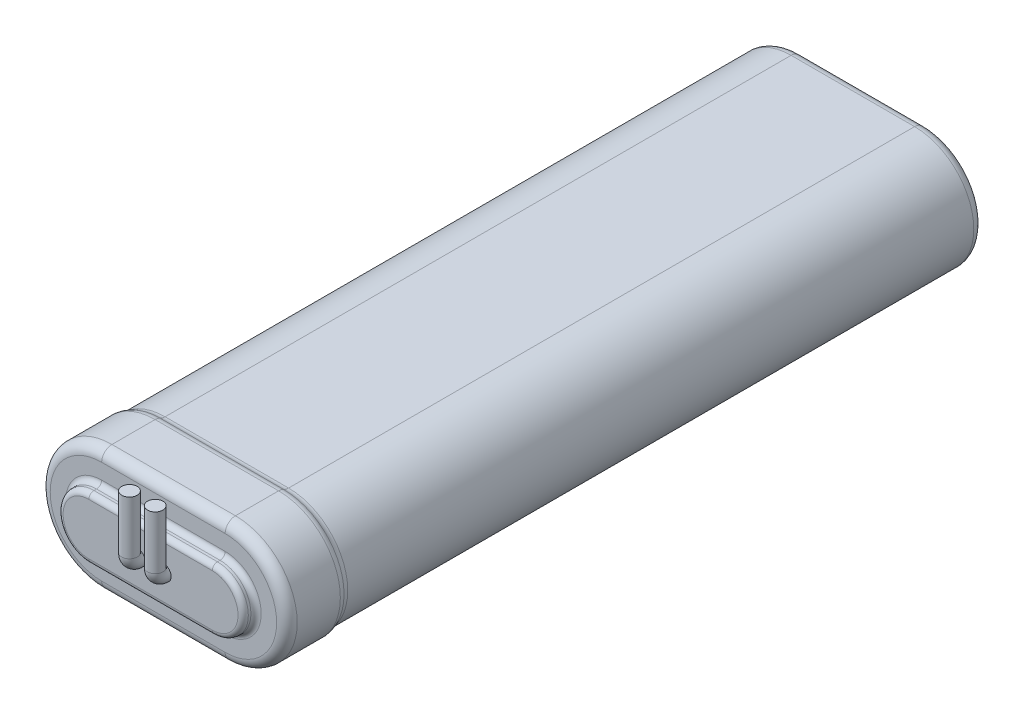
ISO-10303-21;
HEADER;
FILE_DESCRIPTION(('STEP AP214'),'2;1');
FILE_NAME('part.step','',(''),(''),'','','');
FILE_SCHEMA(('AUTOMOTIVE_DESIGN { 1 0 10303 214 1 1 1 1 }'));
ENDSEC;
DATA;
#1=APPLICATION_CONTEXT('core data for automotive mechanical design processes');
#2=APPLICATION_PROTOCOL_DEFINITION('international standard','automotive_design',2000,#1);
#3=PRODUCT_CONTEXT('',#1,'mechanical');
#4=PRODUCT('Part','Part','',(#3));
#5=PRODUCT_RELATED_PRODUCT_CATEGORY('part','',(#4));
#6=PRODUCT_DEFINITION_FORMATION('','',#4);
#7=PRODUCT_DEFINITION_CONTEXT('part definition',#1,'design');
#8=PRODUCT_DEFINITION('design','',#6,#7);
#9=PRODUCT_DEFINITION_SHAPE('','',#8);
#10=(LENGTH_UNIT() NAMED_UNIT(*) SI_UNIT(.MILLI.,.METRE.));
#11=(NAMED_UNIT(*) PLANE_ANGLE_UNIT() SI_UNIT($,.RADIAN.));
#12=(NAMED_UNIT(*) SI_UNIT($,.STERADIAN.) SOLID_ANGLE_UNIT());
#13=UNCERTAINTY_MEASURE_WITH_UNIT(LENGTH_MEASURE(1.E-05),#10,'distance_accuracy_value','');
#14=(GEOMETRIC_REPRESENTATION_CONTEXT(3) GLOBAL_UNCERTAINTY_ASSIGNED_CONTEXT((#13)) GLOBAL_UNIT_ASSIGNED_CONTEXT((#10,
#11,#12)) REPRESENTATION_CONTEXT('',''));
#15=CARTESIAN_POINT('',(0.,0.,0.));
#16=DIRECTION('',(0.,0.,1.));
#17=DIRECTION('',(1.,0.,0.));
#18=AXIS2_PLACEMENT_3D('',#15,#16,#17);
#19=CARTESIAN_POINT('',(-12.,0.,2.5));
#20=DIRECTION('',(0.,0.,1.));
#21=DIRECTION('',(1.,0.,0.));
#22=AXIS2_PLACEMENT_3D('',#19,#20,#21);
#23=PLANE('',#22);
#24=CARTESIAN_POINT('',(-2.5,0.,2.5));
#25=DIRECTION('',(0.,0.,1.));
#26=DIRECTION('',(1.,0.,0.));
#27=AXIS2_PLACEMENT_3D('',#24,#25,#26);
#28=CIRCLE('',#27,1.5);
#29=CARTESIAN_POINT('',(-2.5,-1.5,2.5));
#30=VERTEX_POINT('',#29);
#31=EDGE_CURVE('E11',#30,#30,#28,.T.);
#32=ORIENTED_EDGE('',*,*,#31,.F.);
#33=EDGE_LOOP('',(#32));
#34=FACE_BOUND('',#33,.T.);
#35=CARTESIAN_POINT('',(12.,0.,2.5));
#36=DIRECTION('',(0.,0.,1.));
#37=DIRECTION('',(1.,0.,0.));
#38=AXIS2_PLACEMENT_3D('',#35,#36,#37);
#39=CIRCLE('',#38,5.);
#40=CARTESIAN_POINT('',(12.,-5.,2.5));
#41=VERTEX_POINT('',#40);
#42=CARTESIAN_POINT('',(12.,5.,2.5));
#43=VERTEX_POINT('',#42);
#44=EDGE_CURVE('E269',#41,#43,#39,.T.);
#45=ORIENTED_EDGE('',*,*,#44,.T.);
#46=DIRECTION('',(-1.,0.,0.));
#47=VECTOR('',#46,1.);
#48=CARTESIAN_POINT('',(-12.,5.,2.5));
#49=LINE('',#48,#47);
#50=CARTESIAN_POINT('',(-12.,5.,2.5));
#51=VERTEX_POINT('',#50);
#52=EDGE_CURVE('E271',#43,#51,#49,.T.);
#53=ORIENTED_EDGE('',*,*,#52,.T.);
#54=CARTESIAN_POINT('',(-12.,0.,2.5));
#55=DIRECTION('',(0.,0.,1.));
#56=DIRECTION('',(1.,0.,0.));
#57=AXIS2_PLACEMENT_3D('',#54,#55,#56);
#58=CIRCLE('',#57,5.);
#59=CARTESIAN_POINT('',(-12.,-5.,2.5));
#60=VERTEX_POINT('',#59);
#61=EDGE_CURVE('E265',#51,#60,#58,.T.);
#62=ORIENTED_EDGE('',*,*,#61,.T.);
#63=DIRECTION('',(1.,0.,0.));
#64=VECTOR('',#63,1.);
#65=CARTESIAN_POINT('',(12.,-5.,2.5));
#66=LINE('',#65,#64);
#67=EDGE_CURVE('E267',#60,#41,#66,.T.);
#68=ORIENTED_EDGE('',*,*,#67,.T.);
#69=EDGE_LOOP('',(#45,#53,#62,#68));
#70=FACE_BOUND('',#69,.T.);
#71=CARTESIAN_POINT('',(2.5,0.,2.5));
#72=DIRECTION('',(0.,0.,1.));
#73=DIRECTION('',(1.,0.,0.));
#74=AXIS2_PLACEMENT_3D('',#71,#72,#73);
#75=CIRCLE('',#74,1.5);
#76=CARTESIAN_POINT('',(2.5,-1.5,2.5));
#77=VERTEX_POINT('',#76);
#78=EDGE_CURVE('E897',#77,#77,#75,.T.);
#79=ORIENTED_EDGE('',*,*,#78,.F.);
#80=EDGE_LOOP('',(#79));
#81=FACE_BOUND('',#80,.T.);
#82=ADVANCED_FACE('F16',(#34,#70,#81),#23,.T.);
#83=CARTESIAN_POINT('',(-12.,0.,0.));
#84=DIRECTION('',(0.,0.,-1.));
#85=DIRECTION('',(-1.,0.,0.));
#86=AXIS2_PLACEMENT_3D('',#83,#84,#85);
#87=PLANE('',#86);
#88=DIRECTION('',(-1.,0.,0.));
#89=VECTOR('',#88,1.);
#90=CARTESIAN_POINT('',(12.,7.,0.));
#91=LINE('',#90,#89);
#92=CARTESIAN_POINT('',(-12.,7.,0.));
#93=VERTEX_POINT('',#92);
#94=CARTESIAN_POINT('',(12.,7.,0.));
#95=VERTEX_POINT('',#94);
#96=EDGE_CURVE('E248',#93,#95,#91,.F.);
#97=ORIENTED_EDGE('',*,*,#96,.T.);
#98=CARTESIAN_POINT('',(12.,0.,0.));
#99=DIRECTION('',(0.,0.,-1.));
#100=DIRECTION('',(-1.,0.,0.));
#101=AXIS2_PLACEMENT_3D('',#98,#99,#100);
#102=CIRCLE('',#101,7.);
#103=CARTESIAN_POINT('',(12.,-7.,0.));
#104=VERTEX_POINT('',#103);
#105=EDGE_CURVE('E254',#95,#104,#102,.T.);
#106=ORIENTED_EDGE('',*,*,#105,.T.);
#107=DIRECTION('',(1.,0.,0.));
#108=VECTOR('',#107,1.);
#109=CARTESIAN_POINT('',(-12.,-7.,0.));
#110=LINE('',#109,#108);
#111=CARTESIAN_POINT('',(-12.,-7.,0.));
#112=VERTEX_POINT('',#111);
#113=EDGE_CURVE('E252',#104,#112,#110,.F.);
#114=ORIENTED_EDGE('',*,*,#113,.T.);
#115=CARTESIAN_POINT('',(-12.,0.,0.));
#116=DIRECTION('',(0.,0.,-1.));
#117=DIRECTION('',(-1.,0.,0.));
#118=AXIS2_PLACEMENT_3D('',#115,#116,#117);
#119=CIRCLE('',#118,7.);
#120=EDGE_CURVE('E250',#112,#93,#119,.T.);
#121=ORIENTED_EDGE('',*,*,#120,.T.);
#122=EDGE_LOOP('',(#97,#106,#114,#121));
#123=FACE_BOUND('',#122,.T.);
#124=DIRECTION('',(1.,0.,0.));
#125=VECTOR('',#124,1.);
#126=CARTESIAN_POINT('',(12.,-10.,0.));
#127=LINE('',#126,#125);
#128=CARTESIAN_POINT('',(-12.,-10.,0.));
#129=VERTEX_POINT('',#128);
#130=CARTESIAN_POINT('',(12.,-10.,0.));
#131=VERTEX_POINT('',#130);
#132=EDGE_CURVE('E193',#129,#131,#127,.T.);
#133=ORIENTED_EDGE('',*,*,#132,.T.);
#134=CARTESIAN_POINT('',(12.,0.,0.));
#135=DIRECTION('',(0.,0.,-1.));
#136=DIRECTION('',(-1.,0.,0.));
#137=AXIS2_PLACEMENT_3D('',#134,#135,#136);
#138=CIRCLE('',#137,10.);
#139=CARTESIAN_POINT('',(12.,10.,0.));
#140=VERTEX_POINT('',#139);
#141=EDGE_CURVE('E173',#131,#140,#138,.F.);
#142=ORIENTED_EDGE('',*,*,#141,.T.);
#143=DIRECTION('',(-1.,0.,0.));
#144=VECTOR('',#143,1.);
#145=CARTESIAN_POINT('',(-12.,10.,0.));
#146=LINE('',#145,#144);
#147=CARTESIAN_POINT('',(-12.,10.,0.));
#148=VERTEX_POINT('',#147);
#149=EDGE_CURVE('E182',#140,#148,#146,.T.);
#150=ORIENTED_EDGE('',*,*,#149,.T.);
#151=CARTESIAN_POINT('',(-12.,0.,0.));
#152=DIRECTION('',(0.,0.,-1.));
#153=DIRECTION('',(-1.,0.,0.));
#154=AXIS2_PLACEMENT_3D('',#151,#152,#153);
#155=CIRCLE('',#154,10.);
#156=EDGE_CURVE('E188',#148,#129,#155,.F.);
#157=ORIENTED_EDGE('',*,*,#156,.T.);
#158=EDGE_LOOP('',(#133,#142,#150,#157));
#159=FACE_BOUND('',#158,.T.);
#160=ADVANCED_FACE('F191',(#123,#159),#87,.F.);
#161=CARTESIAN_POINT('',(-12.,0.,-11.));
#162=DIRECTION('',(0.,0.,1.));
#163=DIRECTION('',(1.,0.,0.));
#164=AXIS2_PLACEMENT_3D('',#161,#162,#163);
#165=CYLINDRICAL_SURFACE('',#164,12.);
#166=DIRECTION('',(0.,0.,1.));
#167=VECTOR('',#166,1.);
#168=CARTESIAN_POINT('',(-12.,12.,-11.));
#169=LINE('',#168,#167);
#170=CARTESIAN_POINT('',(-12.,12.,-10.3863839824286));
#171=VERTEX_POINT('',#170);
#172=CARTESIAN_POINT('',(-12.,12.,-2.));
#173=VERTEX_POINT('',#172);
#174=EDGE_CURVE('E189',#171,#173,#169,.T.);
#175=ORIENTED_EDGE('',*,*,#174,.F.);
#176=CARTESIAN_POINT('',(-12.,0.,-10.3863839824286));
#177=DIRECTION('',(0.,0.,-1.));
#178=DIRECTION('',(-1.,0.,0.));
#179=AXIS2_PLACEMENT_3D('',#176,#177,#178);
#180=CIRCLE('',#179,12.);
#181=CARTESIAN_POINT('',(-12.,-12.,-10.3863839824286));
#182=VERTEX_POINT('',#181);
#183=EDGE_CURVE('E328',#171,#182,#180,.F.);
#184=ORIENTED_EDGE('',*,*,#183,.T.);
#185=DIRECTION('',(0.,0.,1.));
#186=VECTOR('',#185,1.);
#187=CARTESIAN_POINT('',(-12.,-12.,-11.));
#188=LINE('',#187,#186);
#189=CARTESIAN_POINT('',(-12.,-12.,-2.));
#190=VERTEX_POINT('',#189);
#191=EDGE_CURVE('E374',#182,#190,#188,.T.);
#192=ORIENTED_EDGE('',*,*,#191,.T.);
#193=CARTESIAN_POINT('',(-12.,0.,-2.));
#194=DIRECTION('',(0.,0.,-1.));
#195=DIRECTION('',(-1.,0.,0.));
#196=AXIS2_PLACEMENT_3D('',#193,#194,#195);
#197=CIRCLE('',#196,12.);
#198=EDGE_CURVE('E203',#190,#173,#197,.T.);
#199=ORIENTED_EDGE('',*,*,#198,.T.);
#200=EDGE_LOOP('',(#175,#184,#192,#199));
#201=FACE_BOUND('',#200,.T.);
#202=ADVANCED_FACE('F390',(#201),#165,.T.);
#203=CARTESIAN_POINT('',(-12.,12.,-11.));
#204=DIRECTION('',(0.,1.,0.));
#205=DIRECTION('',(0.,0.,1.));
#206=AXIS2_PLACEMENT_3D('',#203,#204,#205);
#207=PLANE('',#206);
#208=DIRECTION('',(0.,0.,1.));
#209=VECTOR('',#208,1.);
#210=CARTESIAN_POINT('',(12.,12.,-11.));
#211=LINE('',#210,#209);
#212=CARTESIAN_POINT('',(12.,12.,-10.3863839824286));
#213=VERTEX_POINT('',#212);
#214=CARTESIAN_POINT('',(12.,12.,-2.));
#215=VERTEX_POINT('',#214);
#216=EDGE_CURVE('E369',#213,#215,#211,.T.);
#217=ORIENTED_EDGE('',*,*,#216,.F.);
#218=DIRECTION('',(-1.,0.,0.));
#219=VECTOR('',#218,1.);
#220=CARTESIAN_POINT('',(-12.,12.,-10.3863839824286));
#221=LINE('',#220,#219);
#222=EDGE_CURVE('E39',#213,#171,#221,.T.);
#223=ORIENTED_EDGE('',*,*,#222,.T.);
#224=ORIENTED_EDGE('',*,*,#174,.T.);
#225=DIRECTION('',(-1.,0.,0.));
#226=VECTOR('',#225,1.);
#227=CARTESIAN_POINT('',(12.,12.,-2.));
#228=LINE('',#227,#226);
#229=EDGE_CURVE('E224',#173,#215,#228,.F.);
#230=ORIENTED_EDGE('',*,*,#229,.T.);
#231=EDGE_LOOP('',(#217,#223,#224,#230));
#232=FACE_BOUND('',#231,.T.);
#233=ADVANCED_FACE('F371',(#232),#207,.T.);
#234=CARTESIAN_POINT('',(12.,0.,-11.));
#235=DIRECTION('',(0.,0.,1.));
#236=DIRECTION('',(1.,0.,0.));
#237=AXIS2_PLACEMENT_3D('',#234,#235,#236);
#238=CYLINDRICAL_SURFACE('',#237,12.);
#239=DIRECTION('',(0.,0.,1.));
#240=VECTOR('',#239,1.);
#241=CARTESIAN_POINT('',(12.,-12.,-11.));
#242=LINE('',#241,#240);
#243=CARTESIAN_POINT('',(12.,-12.,-10.3863839824286));
#244=VERTEX_POINT('',#243);
#245=CARTESIAN_POINT('',(12.,-12.,-2.));
#246=VERTEX_POINT('',#245);
#247=EDGE_CURVE('E370',#244,#246,#242,.T.);
#248=ORIENTED_EDGE('',*,*,#247,.F.);
#249=CARTESIAN_POINT('',(12.,0.,-10.3863839824286));
#250=DIRECTION('',(0.,0.,-1.));
#251=DIRECTION('',(-1.,0.,0.));
#252=AXIS2_PLACEMENT_3D('',#249,#250,#251);
#253=CIRCLE('',#252,12.);
#254=EDGE_CURVE('E309',#244,#213,#253,.F.);
#255=ORIENTED_EDGE('',*,*,#254,.T.);
#256=ORIENTED_EDGE('',*,*,#216,.T.);
#257=CARTESIAN_POINT('',(12.,0.,-2.));
#258=DIRECTION('',(0.,0.,-1.));
#259=DIRECTION('',(-1.,0.,0.));
#260=AXIS2_PLACEMENT_3D('',#257,#258,#259);
#261=CIRCLE('',#260,12.);
#262=EDGE_CURVE('E175',#215,#246,#261,.T.);
#263=ORIENTED_EDGE('',*,*,#262,.T.);
#264=EDGE_LOOP('',(#248,#255,#256,#263));
#265=FACE_BOUND('',#264,.T.);
#266=ADVANCED_FACE('F368',(#265),#238,.T.);
#267=CARTESIAN_POINT('',(-12.,-12.,-11.));
#268=DIRECTION('',(0.,-1.,0.));
#269=DIRECTION('',(0.,0.,-1.));
#270=AXIS2_PLACEMENT_3D('',#267,#268,#269);
#271=PLANE('',#270);
#272=ORIENTED_EDGE('',*,*,#191,.F.);
#273=DIRECTION('',(1.,0.,0.));
#274=VECTOR('',#273,1.);
#275=CARTESIAN_POINT('',(12.,-12.,-10.3863839824286));
#276=LINE('',#275,#274);
#277=EDGE_CURVE('E324',#182,#244,#276,.T.);
#278=ORIENTED_EDGE('',*,*,#277,.T.);
#279=ORIENTED_EDGE('',*,*,#247,.T.);
#280=DIRECTION('',(1.,0.,0.));
#281=VECTOR('',#280,1.);
#282=CARTESIAN_POINT('',(-12.,-12.,-2.));
#283=LINE('',#282,#281);
#284=EDGE_CURVE('E196',#246,#190,#283,.F.);
#285=ORIENTED_EDGE('',*,*,#284,.T.);
#286=EDGE_LOOP('',(#272,#278,#279,#285));
#287=FACE_BOUND('',#286,.T.);
#288=ADVANCED_FACE('F388',(#287),#271,.T.);
#289=CARTESIAN_POINT('',(-12.,0.,-136.));
#290=DIRECTION('',(0.,0.,1.));
#291=DIRECTION('',(1.,0.,0.));
#292=AXIS2_PLACEMENT_3D('',#289,#290,#291);
#293=CYLINDRICAL_SURFACE('',#292,11.5);
#294=DIRECTION('',(0.,0.,1.));
#295=VECTOR('',#294,1.);
#296=CARTESIAN_POINT('',(-12.,-11.5,-136.));
#297=LINE('',#296,#295);
#298=CARTESIAN_POINT('',(-12.,-11.5,-134.));
#299=VERTEX_POINT('',#298);
#300=CARTESIAN_POINT('',(-12.,-11.5,-12.3228756555323));
#301=VERTEX_POINT('',#300);
#302=EDGE_CURVE('E921',#299,#301,#297,.T.);
#303=ORIENTED_EDGE('',*,*,#302,.T.);
#304=CARTESIAN_POINT('',(-12.,0.,-12.3228756555323));
#305=DIRECTION('',(0.,0.,1.));
#306=DIRECTION('',(1.,0.,0.));
#307=AXIS2_PLACEMENT_3D('',#304,#305,#306);
#308=CIRCLE('',#307,11.5);
#309=CARTESIAN_POINT('',(-12.,11.5,-12.3228756555323));
#310=VERTEX_POINT('',#309);
#311=EDGE_CURVE('E279',#301,#310,#308,.F.);
#312=ORIENTED_EDGE('',*,*,#311,.T.);
#313=DIRECTION('',(0.,0.,1.));
#314=VECTOR('',#313,1.);
#315=CARTESIAN_POINT('',(-12.,11.5,-136.));
#316=LINE('',#315,#314);
#317=CARTESIAN_POINT('',(-12.,11.5,-134.));
#318=VERTEX_POINT('',#317);
#319=EDGE_CURVE('E378',#318,#310,#316,.T.);
#320=ORIENTED_EDGE('',*,*,#319,.F.);
#321=CARTESIAN_POINT('',(-12.,0.,-134.));
#322=DIRECTION('',(0.,0.,1.));
#323=DIRECTION('',(1.,0.,0.));
#324=AXIS2_PLACEMENT_3D('',#321,#322,#323);
#325=CIRCLE('',#324,11.5);
#326=EDGE_CURVE('E222',#318,#299,#325,.T.);
#327=ORIENTED_EDGE('',*,*,#326,.T.);
#328=EDGE_LOOP('',(#303,#312,#320,#327));
#329=FACE_BOUND('',#328,.T.);
#330=ADVANCED_FACE('F439',(#329),#293,.T.);
#331=CARTESIAN_POINT('',(12.,11.5,-136.));
#332=DIRECTION('',(0.,1.,0.));
#333=DIRECTION('',(0.,0.,1.));
#334=AXIS2_PLACEMENT_3D('',#331,#332,#333);
#335=PLANE('',#334);
#336=ORIENTED_EDGE('',*,*,#319,.T.);
#337=DIRECTION('',(-1.,0.,0.));
#338=VECTOR('',#337,1.);
#339=CARTESIAN_POINT('',(12.,11.5,-12.3228756555323));
#340=LINE('',#339,#338);
#341=CARTESIAN_POINT('',(12.,11.5,-12.3228756555323));
#342=VERTEX_POINT('',#341);
#343=EDGE_CURVE('E306',#310,#342,#340,.F.);
#344=ORIENTED_EDGE('',*,*,#343,.T.);
#345=DIRECTION('',(0.,0.,1.));
#346=VECTOR('',#345,1.);
#347=CARTESIAN_POINT('',(12.,11.5,-136.));
#348=LINE('',#347,#346);
#349=CARTESIAN_POINT('',(12.,11.5,-134.));
#350=VERTEX_POINT('',#349);
#351=EDGE_CURVE('E924',#350,#342,#348,.T.);
#352=ORIENTED_EDGE('',*,*,#351,.F.);
#353=DIRECTION('',(-1.,0.,0.));
#354=VECTOR('',#353,1.);
#355=CARTESIAN_POINT('',(-12.,11.5,-134.));
#356=LINE('',#355,#354);
#357=EDGE_CURVE('E220',#350,#318,#356,.T.);
#358=ORIENTED_EDGE('',*,*,#357,.T.);
#359=EDGE_LOOP('',(#336,#344,#352,#358));
#360=FACE_BOUND('',#359,.T.);
#361=ADVANCED_FACE('F435',(#360),#335,.T.);
#362=CARTESIAN_POINT('',(12.,0.,-136.));
#363=DIRECTION('',(0.,0.,1.));
#364=DIRECTION('',(1.,0.,0.));
#365=AXIS2_PLACEMENT_3D('',#362,#363,#364);
#366=CYLINDRICAL_SURFACE('',#365,11.5);
#367=ORIENTED_EDGE('',*,*,#351,.T.);
#368=CARTESIAN_POINT('',(12.,0.,-12.3228756555323));
#369=DIRECTION('',(0.,0.,1.));
#370=DIRECTION('',(1.,0.,0.));
#371=AXIS2_PLACEMENT_3D('',#368,#369,#370);
#372=CIRCLE('',#371,11.5);
#373=CARTESIAN_POINT('',(12.,-11.5,-12.3228756555323));
#374=VERTEX_POINT('',#373);
#375=EDGE_CURVE('E304',#342,#374,#372,.F.);
#376=ORIENTED_EDGE('',*,*,#375,.T.);
#377=DIRECTION('',(0.,0.,1.));
#378=VECTOR('',#377,1.);
#379=CARTESIAN_POINT('',(12.,-11.5,-136.));
#380=LINE('',#379,#378);
#381=CARTESIAN_POINT('',(12.,-11.5,-134.));
#382=VERTEX_POINT('',#381);
#383=EDGE_CURVE('E927',#382,#374,#380,.T.);
#384=ORIENTED_EDGE('',*,*,#383,.F.);
#385=CARTESIAN_POINT('',(12.,0.,-134.));
#386=DIRECTION('',(0.,0.,1.));
#387=DIRECTION('',(1.,0.,0.));
#388=AXIS2_PLACEMENT_3D('',#385,#386,#387);
#389=CIRCLE('',#388,11.5);
#390=EDGE_CURVE('E218',#382,#350,#389,.T.);
#391=ORIENTED_EDGE('',*,*,#390,.T.);
#392=EDGE_LOOP('',(#367,#376,#384,#391));
#393=FACE_BOUND('',#392,.T.);
#394=ADVANCED_FACE('F438',(#393),#366,.T.);
#395=CARTESIAN_POINT('',(-12.,-11.5,-136.));
#396=DIRECTION('',(0.,-1.,0.));
#397=DIRECTION('',(0.,0.,-1.));
#398=AXIS2_PLACEMENT_3D('',#395,#396,#397);
#399=PLANE('',#398);
#400=ORIENTED_EDGE('',*,*,#383,.T.);
#401=DIRECTION('',(1.,0.,0.));
#402=VECTOR('',#401,1.);
#403=CARTESIAN_POINT('',(-12.,-11.5,-12.3228756555323));
#404=LINE('',#403,#402);
#405=EDGE_CURVE('E302',#374,#301,#404,.F.);
#406=ORIENTED_EDGE('',*,*,#405,.T.);
#407=ORIENTED_EDGE('',*,*,#302,.F.);
#408=DIRECTION('',(1.,0.,0.));
#409=VECTOR('',#408,1.);
#410=CARTESIAN_POINT('',(12.,-11.5,-134.));
#411=LINE('',#410,#409);
#412=EDGE_CURVE('E206',#299,#382,#411,.T.);
#413=ORIENTED_EDGE('',*,*,#412,.T.);
#414=EDGE_LOOP('',(#400,#406,#407,#413));
#415=FACE_BOUND('',#414,.T.);
#416=ADVANCED_FACE('F433',(#415),#399,.T.);
#417=CARTESIAN_POINT('',(-12.,0.,-136.));
#418=DIRECTION('',(0.,0.,1.));
#419=DIRECTION('',(1.,0.,0.));
#420=AXIS2_PLACEMENT_3D('',#417,#418,#419);
#421=PLANE('',#420);
#422=CARTESIAN_POINT('',(12.,0.,-136.));
#423=DIRECTION('',(0.,0.,1.));
#424=DIRECTION('',(1.,0.,0.));
#425=AXIS2_PLACEMENT_3D('',#422,#423,#424);
#426=CIRCLE('',#425,9.5);
#427=CARTESIAN_POINT('',(12.,9.5,-136.));
#428=VERTEX_POINT('',#427);
#429=CARTESIAN_POINT('',(12.,-9.5,-136.));
#430=VERTEX_POINT('',#429);
#431=EDGE_CURVE('E213',#428,#430,#426,.F.);
#432=ORIENTED_EDGE('',*,*,#431,.T.);
#433=DIRECTION('',(1.,0.,0.));
#434=VECTOR('',#433,1.);
#435=CARTESIAN_POINT('',(-12.,-9.5,-136.));
#436=LINE('',#435,#434);
#437=CARTESIAN_POINT('',(-12.,-9.5,-136.));
#438=VERTEX_POINT('',#437);
#439=EDGE_CURVE('E215',#430,#438,#436,.F.);
#440=ORIENTED_EDGE('',*,*,#439,.T.);
#441=CARTESIAN_POINT('',(-12.,0.,-136.));
#442=DIRECTION('',(0.,0.,1.));
#443=DIRECTION('',(1.,0.,0.));
#444=AXIS2_PLACEMENT_3D('',#441,#442,#443);
#445=CIRCLE('',#444,9.5);
#446=CARTESIAN_POINT('',(-12.,9.5,-136.));
#447=VERTEX_POINT('',#446);
#448=EDGE_CURVE('E209',#438,#447,#445,.F.);
#449=ORIENTED_EDGE('',*,*,#448,.T.);
#450=DIRECTION('',(-1.,0.,0.));
#451=VECTOR('',#450,1.);
#452=CARTESIAN_POINT('',(12.,9.5,-136.));
#453=LINE('',#452,#451);
#454=EDGE_CURVE('E211',#447,#428,#453,.F.);
#455=ORIENTED_EDGE('',*,*,#454,.T.);
#456=EDGE_LOOP('',(#432,#440,#449,#455));
#457=FACE_BOUND('',#456,.T.);
#458=ADVANCED_FACE('F429',(#457),#421,.F.);
#459=CARTESIAN_POINT('',(-12.,0.,2.5));
#460=DIRECTION('',(0.,0.,-1.));
#461=DIRECTION('',(-1.,0.,0.));
#462=AXIS2_PLACEMENT_3D('',#459,#460,#461);
#463=CYLINDRICAL_SURFACE('',#462,6.);
#464=DIRECTION('',(0.,0.,-1.));
#465=VECTOR('',#464,1.);
#466=CARTESIAN_POINT('',(-12.,6.,2.5));
#467=LINE('',#466,#465);
#468=CARTESIAN_POINT('',(-12.,6.,1.5));
#469=VERTEX_POINT('',#468);
#470=CARTESIAN_POINT('',(-12.,6.,1.));
#471=VERTEX_POINT('',#470);
#472=EDGE_CURVE('E233',#469,#471,#467,.T.);
#473=ORIENTED_EDGE('',*,*,#472,.T.);
#474=CARTESIAN_POINT('',(-12.,0.,1.));
#475=DIRECTION('',(0.,0.,-1.));
#476=DIRECTION('',(-1.,0.,0.));
#477=AXIS2_PLACEMENT_3D('',#474,#475,#476);
#478=CIRCLE('',#477,6.);
#479=CARTESIAN_POINT('',(-12.,-6.,1.));
#480=VERTEX_POINT('',#479);
#481=EDGE_CURVE('E263',#471,#480,#478,.F.);
#482=ORIENTED_EDGE('',*,*,#481,.T.);
#483=DIRECTION('',(0.,0.,-1.));
#484=VECTOR('',#483,1.);
#485=CARTESIAN_POINT('',(-12.,-6.,2.5));
#486=LINE('',#485,#484);
#487=CARTESIAN_POINT('',(-12.,-6.,1.5));
#488=VERTEX_POINT('',#487);
#489=EDGE_CURVE('E918',#488,#480,#486,.T.);
#490=ORIENTED_EDGE('',*,*,#489,.F.);
#491=CARTESIAN_POINT('',(-12.,0.,1.5));
#492=DIRECTION('',(0.,0.,1.));
#493=DIRECTION('',(1.,0.,0.));
#494=AXIS2_PLACEMENT_3D('',#491,#492,#493);
#495=CIRCLE('',#494,6.);
#496=EDGE_CURVE('E261',#488,#469,#495,.F.);
#497=ORIENTED_EDGE('',*,*,#496,.T.);
#498=EDGE_LOOP('',(#473,#482,#490,#497));
#499=FACE_BOUND('',#498,.T.);
#500=ADVANCED_FACE('F425',(#499),#463,.T.);
#501=CARTESIAN_POINT('',(-12.,-6.,2.5));
#502=DIRECTION('',(0.,1.,0.));
#503=DIRECTION('',(0.,0.,1.));
#504=AXIS2_PLACEMENT_3D('',#501,#502,#503);
#505=PLANE('',#504);
#506=ORIENTED_EDGE('',*,*,#489,.T.);
#507=DIRECTION('',(1.,0.,0.));
#508=VECTOR('',#507,1.);
#509=CARTESIAN_POINT('',(12.,-6.,1.));
#510=LINE('',#509,#508);
#511=CARTESIAN_POINT('',(12.,-6.,1.));
#512=VERTEX_POINT('',#511);
#513=EDGE_CURVE('E259',#480,#512,#510,.T.);
#514=ORIENTED_EDGE('',*,*,#513,.T.);
#515=DIRECTION('',(0.,0.,-1.));
#516=VECTOR('',#515,1.);
#517=CARTESIAN_POINT('',(12.,-6.,2.5));
#518=LINE('',#517,#516);
#519=CARTESIAN_POINT('',(12.,-6.,1.5));
#520=VERTEX_POINT('',#519);
#521=EDGE_CURVE('E915',#520,#512,#518,.T.);
#522=ORIENTED_EDGE('',*,*,#521,.F.);
#523=DIRECTION('',(1.,0.,0.));
#524=VECTOR('',#523,1.);
#525=CARTESIAN_POINT('',(-12.,-6.,1.5));
#526=LINE('',#525,#524);
#527=EDGE_CURVE('E257',#520,#488,#526,.F.);
#528=ORIENTED_EDGE('',*,*,#527,.T.);
#529=EDGE_LOOP('',(#506,#514,#522,#528));
#530=FACE_BOUND('',#529,.T.);
#531=ADVANCED_FACE('F421',(#530),#505,.F.);
#532=CARTESIAN_POINT('',(12.,0.,2.5));
#533=DIRECTION('',(0.,0.,-1.));
#534=DIRECTION('',(-1.,0.,0.));
#535=AXIS2_PLACEMENT_3D('',#532,#533,#534);
#536=CYLINDRICAL_SURFACE('',#535,6.);
#537=ORIENTED_EDGE('',*,*,#521,.T.);
#538=CARTESIAN_POINT('',(12.,0.,1.));
#539=DIRECTION('',(0.,0.,-1.));
#540=DIRECTION('',(-1.,0.,0.));
#541=AXIS2_PLACEMENT_3D('',#538,#539,#540);
#542=CIRCLE('',#541,6.);
#543=CARTESIAN_POINT('',(12.,6.,1.));
#544=VERTEX_POINT('',#543);
#545=EDGE_CURVE('E245',#512,#544,#542,.F.);
#546=ORIENTED_EDGE('',*,*,#545,.T.);
#547=DIRECTION('',(0.,0.,-1.));
#548=VECTOR('',#547,1.);
#549=CARTESIAN_POINT('',(12.,6.,2.5));
#550=LINE('',#549,#548);
#551=CARTESIAN_POINT('',(12.,6.,1.5));
#552=VERTEX_POINT('',#551);
#553=EDGE_CURVE('E912',#552,#544,#550,.T.);
#554=ORIENTED_EDGE('',*,*,#553,.F.);
#555=CARTESIAN_POINT('',(12.,0.,1.5));
#556=DIRECTION('',(0.,0.,1.));
#557=DIRECTION('',(1.,0.,0.));
#558=AXIS2_PLACEMENT_3D('',#555,#556,#557);
#559=CIRCLE('',#558,6.);
#560=EDGE_CURVE('E226',#552,#520,#559,.F.);
#561=ORIENTED_EDGE('',*,*,#560,.T.);
#562=EDGE_LOOP('',(#537,#546,#554,#561));
#563=FACE_BOUND('',#562,.T.);
#564=ADVANCED_FACE('F417',(#563),#536,.T.);
#565=CARTESIAN_POINT('',(12.,6.,2.5));
#566=DIRECTION('',(0.,-1.,0.));
#567=DIRECTION('',(0.,0.,-1.));
#568=AXIS2_PLACEMENT_3D('',#565,#566,#567);
#569=PLANE('',#568);
#570=ORIENTED_EDGE('',*,*,#472,.F.);
#571=DIRECTION('',(-1.,0.,0.));
#572=VECTOR('',#571,1.);
#573=CARTESIAN_POINT('',(12.,6.,1.5));
#574=LINE('',#573,#572);
#575=EDGE_CURVE('E276',#469,#552,#574,.F.);
#576=ORIENTED_EDGE('',*,*,#575,.T.);
#577=ORIENTED_EDGE('',*,*,#553,.T.);
#578=DIRECTION('',(-1.,0.,0.));
#579=VECTOR('',#578,1.);
#580=CARTESIAN_POINT('',(-12.,6.,1.));
#581=LINE('',#580,#579);
#582=EDGE_CURVE('E274',#544,#471,#581,.T.);
#583=ORIENTED_EDGE('',*,*,#582,.T.);
#584=EDGE_LOOP('',(#570,#576,#577,#583));
#585=FACE_BOUND('',#584,.T.);
#586=ADVANCED_FACE('F414',(#585),#569,.F.);
#587=CARTESIAN_POINT('',(-12.,0.,-2.));
#588=DIRECTION('',(0.,0.,-1.));
#589=DIRECTION('',(-1.,0.,0.));
#590=AXIS2_PLACEMENT_3D('',#587,#588,#589);
#591=TOROIDAL_SURFACE('',#590,10.,2.);
#592=CARTESIAN_POINT('',(-12.,10.,-2.));
#593=DIRECTION('',(1.,0.,0.));
#594=DIRECTION('',(0.,0.,-1.));
#595=AXIS2_PLACEMENT_3D('',#592,#593,#594);
#596=CIRCLE('',#595,2.);
#597=EDGE_CURVE('E185',#173,#148,#596,.T.);
#598=ORIENTED_EDGE('',*,*,#597,.F.);
#599=ORIENTED_EDGE('',*,*,#198,.F.);
#600=CARTESIAN_POINT('',(-12.,-10.,-2.));
#601=DIRECTION('',(1.,0.,0.));
#602=DIRECTION('',(0.,0.,-1.));
#603=AXIS2_PLACEMENT_3D('',#600,#601,#602);
#604=CIRCLE('',#603,2.);
#605=EDGE_CURVE('E230',#129,#190,#604,.T.);
#606=ORIENTED_EDGE('',*,*,#605,.F.);
#607=ORIENTED_EDGE('',*,*,#156,.F.);
#608=EDGE_LOOP('',(#598,#599,#606,#607));
#609=FACE_BOUND('',#608,.T.);
#610=ADVANCED_FACE('F382',(#609),#591,.T.);
#611=CARTESIAN_POINT('',(-12.,-10.,-2.));
#612=DIRECTION('',(-1.,0.,0.));
#613=DIRECTION('',(0.,0.,1.));
#614=AXIS2_PLACEMENT_3D('',#611,#612,#613);
#615=CYLINDRICAL_SURFACE('',#614,2.);
#616=ORIENTED_EDGE('',*,*,#605,.T.);
#617=ORIENTED_EDGE('',*,*,#284,.F.);
#618=CARTESIAN_POINT('',(12.,-10.,-2.));
#619=DIRECTION('',(1.,0.,0.));
#620=DIRECTION('',(0.,0.,-1.));
#621=AXIS2_PLACEMENT_3D('',#618,#619,#620);
#622=CIRCLE('',#621,2.);
#623=EDGE_CURVE('E178',#131,#246,#622,.T.);
#624=ORIENTED_EDGE('',*,*,#623,.F.);
#625=ORIENTED_EDGE('',*,*,#132,.F.);
#626=EDGE_LOOP('',(#616,#617,#624,#625));
#627=FACE_BOUND('',#626,.T.);
#628=ADVANCED_FACE('F385',(#627),#615,.T.);
#629=CARTESIAN_POINT('',(-12.,10.,-2.));
#630=DIRECTION('',(1.,0.,0.));
#631=DIRECTION('',(0.,0.,-1.));
#632=AXIS2_PLACEMENT_3D('',#629,#630,#631);
#633=CYLINDRICAL_SURFACE('',#632,2.);
#634=ORIENTED_EDGE('',*,*,#597,.T.);
#635=ORIENTED_EDGE('',*,*,#149,.F.);
#636=CARTESIAN_POINT('',(12.,10.,-2.));
#637=DIRECTION('',(1.,0.,0.));
#638=DIRECTION('',(0.,0.,-1.));
#639=AXIS2_PLACEMENT_3D('',#636,#637,#638);
#640=CIRCLE('',#639,2.);
#641=EDGE_CURVE('E168',#215,#140,#640,.T.);
#642=ORIENTED_EDGE('',*,*,#641,.F.);
#643=ORIENTED_EDGE('',*,*,#229,.F.);
#644=EDGE_LOOP('',(#634,#635,#642,#643));
#645=FACE_BOUND('',#644,.T.);
#646=ADVANCED_FACE('F183',(#645),#633,.T.);
#647=CARTESIAN_POINT('',(12.,0.,-2.));
#648=DIRECTION('',(0.,0.,-1.));
#649=DIRECTION('',(-1.,0.,0.));
#650=AXIS2_PLACEMENT_3D('',#647,#648,#649);
#651=TOROIDAL_SURFACE('',#650,10.,2.);
#652=ORIENTED_EDGE('',*,*,#623,.T.);
#653=ORIENTED_EDGE('',*,*,#262,.F.);
#654=ORIENTED_EDGE('',*,*,#641,.T.);
#655=ORIENTED_EDGE('',*,*,#141,.F.);
#656=EDGE_LOOP('',(#652,#653,#654,#655));
#657=FACE_BOUND('',#656,.T.);
#658=ADVANCED_FACE('F171',(#657),#651,.T.);
#659=CARTESIAN_POINT('',(12.,9.5,-134.));
#660=DIRECTION('',(1.,0.,0.));
#661=DIRECTION('',(0.,0.,-1.));
#662=AXIS2_PLACEMENT_3D('',#659,#660,#661);
#663=CYLINDRICAL_SURFACE('',#662,2.);
#664=CARTESIAN_POINT('',(12.,9.5,-134.));
#665=DIRECTION('',(1.,0.,0.));
#666=DIRECTION('',(0.,0.,-1.));
#667=AXIS2_PLACEMENT_3D('',#664,#665,#666);
#668=CIRCLE('',#667,2.);
#669=EDGE_CURVE('E239',#428,#350,#668,.T.);
#670=ORIENTED_EDGE('',*,*,#669,.F.);
#671=ORIENTED_EDGE('',*,*,#454,.F.);
#672=CARTESIAN_POINT('',(-12.,9.5,-134.));
#673=DIRECTION('',(-1.,0.,0.));
#674=DIRECTION('',(0.,0.,1.));
#675=AXIS2_PLACEMENT_3D('',#672,#673,#674);
#676=CIRCLE('',#675,2.);
#677=EDGE_CURVE('E179',#318,#447,#676,.T.);
#678=ORIENTED_EDGE('',*,*,#677,.F.);
#679=ORIENTED_EDGE('',*,*,#357,.F.);
#680=EDGE_LOOP('',(#670,#671,#678,#679));
#681=FACE_BOUND('',#680,.T.);
#682=ADVANCED_FACE('F528',(#681),#663,.T.);
#683=CARTESIAN_POINT('',(-12.,0.,-134.));
#684=DIRECTION('',(0.,0.,1.));
#685=DIRECTION('',(1.,0.,0.));
#686=AXIS2_PLACEMENT_3D('',#683,#684,#685);
#687=TOROIDAL_SURFACE('',#686,9.5,2.);
#688=ORIENTED_EDGE('',*,*,#677,.T.);
#689=ORIENTED_EDGE('',*,*,#448,.F.);
#690=CARTESIAN_POINT('',(-12.,-9.5,-134.));
#691=DIRECTION('',(1.,0.,0.));
#692=DIRECTION('',(0.,0.,-1.));
#693=AXIS2_PLACEMENT_3D('',#690,#691,#692);
#694=CIRCLE('',#693,2.);
#695=EDGE_CURVE('E236',#299,#438,#694,.T.);
#696=ORIENTED_EDGE('',*,*,#695,.F.);
#697=ORIENTED_EDGE('',*,*,#326,.F.);
#698=EDGE_LOOP('',(#688,#689,#696,#697));
#699=FACE_BOUND('',#698,.T.);
#700=ADVANCED_FACE('F535',(#699),#687,.T.);
#701=CARTESIAN_POINT('',(12.,0.,-134.));
#702=DIRECTION('',(0.,0.,1.));
#703=DIRECTION('',(1.,0.,0.));
#704=AXIS2_PLACEMENT_3D('',#701,#702,#703);
#705=TOROIDAL_SURFACE('',#704,9.5,2.);
#706=ORIENTED_EDGE('',*,*,#669,.T.);
#707=ORIENTED_EDGE('',*,*,#390,.F.);
#708=CARTESIAN_POINT('',(12.,-9.5,-134.));
#709=DIRECTION('',(-1.,0.,0.));
#710=DIRECTION('',(0.,0.,1.));
#711=AXIS2_PLACEMENT_3D('',#708,#709,#710);
#712=CIRCLE('',#711,2.);
#713=EDGE_CURVE('E234',#430,#382,#712,.T.);
#714=ORIENTED_EDGE('',*,*,#713,.F.);
#715=ORIENTED_EDGE('',*,*,#431,.F.);
#716=EDGE_LOOP('',(#706,#707,#714,#715));
#717=FACE_BOUND('',#716,.T.);
#718=ADVANCED_FACE('F544',(#717),#705,.T.);
#719=CARTESIAN_POINT('',(-12.,-9.5,-134.));
#720=DIRECTION('',(-1.,0.,0.));
#721=DIRECTION('',(0.,0.,1.));
#722=AXIS2_PLACEMENT_3D('',#719,#720,#721);
#723=CYLINDRICAL_SURFACE('',#722,2.);
#724=ORIENTED_EDGE('',*,*,#695,.T.);
#725=ORIENTED_EDGE('',*,*,#439,.F.);
#726=ORIENTED_EDGE('',*,*,#713,.T.);
#727=ORIENTED_EDGE('',*,*,#412,.F.);
#728=EDGE_LOOP('',(#724,#725,#726,#727));
#729=FACE_BOUND('',#728,.T.);
#730=ADVANCED_FACE('F553',(#729),#723,.T.);
#731=CARTESIAN_POINT('',(-12.,0.,1.));
#732=DIRECTION('',(0.,0.,-1.));
#733=DIRECTION('',(-1.,0.,0.));
#734=AXIS2_PLACEMENT_3D('',#731,#732,#733);
#735=TOROIDAL_SURFACE('',#734,7.,1.);
#736=CARTESIAN_POINT('',(-12.,7.,1.));
#737=DIRECTION('',(-1.,0.,0.));
#738=DIRECTION('',(0.,0.,1.));
#739=AXIS2_PLACEMENT_3D('',#736,#737,#738);
#740=CIRCLE('',#739,1.);
#741=EDGE_CURVE('E285',#93,#471,#740,.T.);
#742=ORIENTED_EDGE('',*,*,#741,.F.);
#743=ORIENTED_EDGE('',*,*,#120,.F.);
#744=CARTESIAN_POINT('',(-12.,-7.,1.));
#745=DIRECTION('',(-1.,0.,0.));
#746=DIRECTION('',(0.,0.,1.));
#747=AXIS2_PLACEMENT_3D('',#744,#745,#746);
#748=CIRCLE('',#747,1.);
#749=EDGE_CURVE('E237',#480,#112,#748,.T.);
#750=ORIENTED_EDGE('',*,*,#749,.F.);
#751=ORIENTED_EDGE('',*,*,#481,.F.);
#752=EDGE_LOOP('',(#742,#743,#750,#751));
#753=FACE_BOUND('',#752,.T.);
#754=ADVANCED_FACE('F562',(#753),#735,.F.);
#755=CARTESIAN_POINT('',(-12.,-7.,1.));
#756=DIRECTION('',(-1.,0.,0.));
#757=DIRECTION('',(0.,0.,1.));
#758=AXIS2_PLACEMENT_3D('',#755,#756,#757);
#759=CYLINDRICAL_SURFACE('',#758,1.);
#760=ORIENTED_EDGE('',*,*,#749,.T.);
#761=ORIENTED_EDGE('',*,*,#113,.F.);
#762=CARTESIAN_POINT('',(12.,-7.,1.));
#763=DIRECTION('',(-1.,0.,0.));
#764=DIRECTION('',(0.,0.,1.));
#765=AXIS2_PLACEMENT_3D('',#762,#763,#764);
#766=CIRCLE('',#765,1.);
#767=EDGE_CURVE('E282',#512,#104,#766,.T.);
#768=ORIENTED_EDGE('',*,*,#767,.F.);
#769=ORIENTED_EDGE('',*,*,#513,.F.);
#770=EDGE_LOOP('',(#760,#761,#768,#769));
#771=FACE_BOUND('',#770,.T.);
#772=ADVANCED_FACE('F571',(#771),#759,.F.);
#773=CARTESIAN_POINT('',(12.,7.,1.));
#774=DIRECTION('',(1.,0.,0.));
#775=DIRECTION('',(0.,0.,-1.));
#776=AXIS2_PLACEMENT_3D('',#773,#774,#775);
#777=CYLINDRICAL_SURFACE('',#776,1.);
#778=ORIENTED_EDGE('',*,*,#741,.T.);
#779=ORIENTED_EDGE('',*,*,#582,.F.);
#780=CARTESIAN_POINT('',(12.,7.,1.));
#781=DIRECTION('',(-1.,0.,0.));
#782=DIRECTION('',(0.,0.,1.));
#783=AXIS2_PLACEMENT_3D('',#780,#781,#782);
#784=CIRCLE('',#783,1.);
#785=EDGE_CURVE('E280',#95,#544,#784,.T.);
#786=ORIENTED_EDGE('',*,*,#785,.F.);
#787=ORIENTED_EDGE('',*,*,#96,.F.);
#788=EDGE_LOOP('',(#778,#779,#786,#787));
#789=FACE_BOUND('',#788,.T.);
#790=ADVANCED_FACE('F578',(#789),#777,.F.);
#791=CARTESIAN_POINT('',(12.,0.,1.));
#792=DIRECTION('',(0.,0.,-1.));
#793=DIRECTION('',(-1.,0.,0.));
#794=AXIS2_PLACEMENT_3D('',#791,#792,#793);
#795=TOROIDAL_SURFACE('',#794,7.,1.);
#796=ORIENTED_EDGE('',*,*,#767,.T.);
#797=ORIENTED_EDGE('',*,*,#105,.F.);
#798=ORIENTED_EDGE('',*,*,#785,.T.);
#799=ORIENTED_EDGE('',*,*,#545,.F.);
#800=EDGE_LOOP('',(#796,#797,#798,#799));
#801=FACE_BOUND('',#800,.T.);
#802=ADVANCED_FACE('F586',(#801),#795,.F.);
#803=CARTESIAN_POINT('',(-12.,-5.,1.5));
#804=DIRECTION('',(-1.,0.,0.));
#805=DIRECTION('',(0.,0.,1.));
#806=AXIS2_PLACEMENT_3D('',#803,#804,#805);
#807=CYLINDRICAL_SURFACE('',#806,1.);
#808=CARTESIAN_POINT('',(-12.,-5.,1.5));
#809=DIRECTION('',(-1.,0.,0.));
#810=DIRECTION('',(0.,0.,1.));
#811=AXIS2_PLACEMENT_3D('',#808,#809,#810);
#812=CIRCLE('',#811,1.);
#813=EDGE_CURVE('E295',#488,#60,#812,.T.);
#814=ORIENTED_EDGE('',*,*,#813,.F.);
#815=ORIENTED_EDGE('',*,*,#527,.F.);
#816=CARTESIAN_POINT('',(12.,-5.,1.5));
#817=DIRECTION('',(1.,0.,0.));
#818=DIRECTION('',(0.,0.,-1.));
#819=AXIS2_PLACEMENT_3D('',#816,#817,#818);
#820=CIRCLE('',#819,1.);
#821=EDGE_CURVE('E283',#41,#520,#820,.T.);
#822=ORIENTED_EDGE('',*,*,#821,.F.);
#823=ORIENTED_EDGE('',*,*,#67,.F.);
#824=EDGE_LOOP('',(#814,#815,#822,#823));
#825=FACE_BOUND('',#824,.T.);
#826=ADVANCED_FACE('F594',(#825),#807,.T.);
#827=CARTESIAN_POINT('',(12.,0.,1.5));
#828=DIRECTION('',(0.,0.,1.));
#829=DIRECTION('',(1.,0.,0.));
#830=AXIS2_PLACEMENT_3D('',#827,#828,#829);
#831=TOROIDAL_SURFACE('',#830,5.,1.);
#832=ORIENTED_EDGE('',*,*,#821,.T.);
#833=ORIENTED_EDGE('',*,*,#560,.F.);
#834=CARTESIAN_POINT('',(12.,5.,1.5));
#835=DIRECTION('',(-1.,0.,0.));
#836=DIRECTION('',(0.,0.,1.));
#837=AXIS2_PLACEMENT_3D('',#834,#835,#836);
#838=CIRCLE('',#837,1.);
#839=EDGE_CURVE('E292',#43,#552,#838,.T.);
#840=ORIENTED_EDGE('',*,*,#839,.F.);
#841=ORIENTED_EDGE('',*,*,#44,.F.);
#842=EDGE_LOOP('',(#832,#833,#840,#841));
#843=FACE_BOUND('',#842,.T.);
#844=ADVANCED_FACE('F602',(#843),#831,.T.);
#845=CARTESIAN_POINT('',(-12.,0.,1.5));
#846=DIRECTION('',(0.,0.,1.));
#847=DIRECTION('',(1.,0.,0.));
#848=AXIS2_PLACEMENT_3D('',#845,#846,#847);
#849=TOROIDAL_SURFACE('',#848,5.,1.);
#850=ORIENTED_EDGE('',*,*,#813,.T.);
#851=ORIENTED_EDGE('',*,*,#61,.F.);
#852=CARTESIAN_POINT('',(-12.,5.,1.5));
#853=DIRECTION('',(1.,0.,0.));
#854=DIRECTION('',(0.,0.,-1.));
#855=AXIS2_PLACEMENT_3D('',#852,#853,#854);
#856=CIRCLE('',#855,1.);
#857=EDGE_CURVE('E290',#469,#51,#856,.T.);
#858=ORIENTED_EDGE('',*,*,#857,.F.);
#859=ORIENTED_EDGE('',*,*,#496,.F.);
#860=EDGE_LOOP('',(#850,#851,#858,#859));
#861=FACE_BOUND('',#860,.T.);
#862=ADVANCED_FACE('F610',(#861),#849,.T.);
#863=CARTESIAN_POINT('',(-12.,5.,1.5));
#864=DIRECTION('',(1.,0.,0.));
#865=DIRECTION('',(0.,0.,-1.));
#866=AXIS2_PLACEMENT_3D('',#863,#864,#865);
#867=CYLINDRICAL_SURFACE('',#866,1.);
#868=ORIENTED_EDGE('',*,*,#839,.T.);
#869=ORIENTED_EDGE('',*,*,#575,.F.);
#870=ORIENTED_EDGE('',*,*,#857,.T.);
#871=ORIENTED_EDGE('',*,*,#52,.F.);
#872=EDGE_LOOP('',(#868,#869,#870,#871));
#873=FACE_BOUND('',#872,.T.);
#874=ADVANCED_FACE('F618',(#873),#867,.T.);
#875=CARTESIAN_POINT('',(12.,0.,-12.3228756555323));
#876=DIRECTION('',(0.,0.,1.));
#877=DIRECTION('',(1.,0.,0.));
#878=AXIS2_PLACEMENT_3D('',#875,#876,#877);
#879=TOROIDAL_SURFACE('',#878,13.5,2.);
#880=CARTESIAN_POINT('',(12.,13.5,-12.3228756555323));
#881=DIRECTION('',(1.,0.,0.));
#882=DIRECTION('',(0.,0.,-1.));
#883=AXIS2_PLACEMENT_3D('',#880,#881,#882);
#884=CIRCLE('',#883,2.);
#885=CARTESIAN_POINT('',(12.,11.75,-11.3546298189804));
#886=VERTEX_POINT('',#885);
#887=EDGE_CURVE('E315',#886,#342,#884,.T.);
#888=ORIENTED_EDGE('',*,*,#887,.F.);
#889=CARTESIAN_POINT('',(12.,0.,-11.3546298189804));
#890=DIRECTION('',(0.,0.,-1.));
#891=DIRECTION('',(-1.,0.,0.));
#892=AXIS2_PLACEMENT_3D('',#889,#890,#891);
#893=CIRCLE('',#892,11.75);
#894=CARTESIAN_POINT('',(12.,-11.75,-11.3546298189804));
#895=VERTEX_POINT('',#894);
#896=EDGE_CURVE('E321',#886,#895,#893,.T.);
#897=ORIENTED_EDGE('',*,*,#896,.T.);
#898=CARTESIAN_POINT('',(12.,-13.5,-12.3228756555323));
#899=DIRECTION('',(1.,0.,0.));
#900=DIRECTION('',(0.,0.,-1.));
#901=AXIS2_PLACEMENT_3D('',#898,#899,#900);
#902=CIRCLE('',#901,2.);
#903=EDGE_CURVE('E293',#374,#895,#902,.T.);
#904=ORIENTED_EDGE('',*,*,#903,.F.);
#905=ORIENTED_EDGE('',*,*,#375,.F.);
#906=EDGE_LOOP('',(#888,#897,#904,#905));
#907=FACE_BOUND('',#906,.T.);
#908=ADVANCED_FACE('F361',(#907),#879,.F.);
#909=CARTESIAN_POINT('',(-12.,-13.5,-12.3228756555323));
#910=DIRECTION('',(-1.,0.,0.));
#911=DIRECTION('',(0.,0.,1.));
#912=AXIS2_PLACEMENT_3D('',#909,#910,#911);
#913=CYLINDRICAL_SURFACE('',#912,2.);
#914=ORIENTED_EDGE('',*,*,#903,.T.);
#915=DIRECTION('',(-1.,0.,0.));
#916=VECTOR('',#915,1.);
#917=CARTESIAN_POINT('',(-12.,-11.75,-11.3546298189804));
#918=LINE('',#917,#916);
#919=CARTESIAN_POINT('',(-12.,-11.75,-11.3546298189804));
#920=VERTEX_POINT('',#919);
#921=EDGE_CURVE('E326',#895,#920,#918,.T.);
#922=ORIENTED_EDGE('',*,*,#921,.T.);
#923=CARTESIAN_POINT('',(-12.,-13.5,-12.3228756555323));
#924=DIRECTION('',(1.,0.,0.));
#925=DIRECTION('',(0.,0.,-1.));
#926=AXIS2_PLACEMENT_3D('',#923,#924,#925);
#927=CIRCLE('',#926,2.);
#928=EDGE_CURVE('E312',#301,#920,#927,.T.);
#929=ORIENTED_EDGE('',*,*,#928,.F.);
#930=ORIENTED_EDGE('',*,*,#405,.F.);
#931=EDGE_LOOP('',(#914,#922,#929,#930));
#932=FACE_BOUND('',#931,.T.);
#933=ADVANCED_FACE('F634',(#932),#913,.F.);
#934=CARTESIAN_POINT('',(-12.,13.5,-12.3228756555323));
#935=DIRECTION('',(1.,0.,0.));
#936=DIRECTION('',(0.,0.,-1.));
#937=AXIS2_PLACEMENT_3D('',#934,#935,#936);
#938=CYLINDRICAL_SURFACE('',#937,2.);
#939=CARTESIAN_POINT('',(-12.,13.5,-12.3228756555323));
#940=DIRECTION('',(1.,0.,0.));
#941=DIRECTION('',(0.,0.,-1.));
#942=AXIS2_PLACEMENT_3D('',#939,#940,#941);
#943=CIRCLE('',#942,2.);
#944=CARTESIAN_POINT('',(-12.,11.75,-11.3546298189804));
#945=VERTEX_POINT('',#944);
#946=EDGE_CURVE('E310',#945,#310,#943,.T.);
#947=ORIENTED_EDGE('',*,*,#946,.F.);
#948=DIRECTION('',(1.,0.,0.));
#949=VECTOR('',#948,1.);
#950=CARTESIAN_POINT('',(-12.,11.75,-11.3546298189804));
#951=LINE('',#950,#949);
#952=EDGE_CURVE('E24',#945,#886,#951,.T.);
#953=ORIENTED_EDGE('',*,*,#952,.T.);
#954=ORIENTED_EDGE('',*,*,#887,.T.);
#955=ORIENTED_EDGE('',*,*,#343,.F.);
#956=EDGE_LOOP('',(#947,#953,#954,#955));
#957=FACE_BOUND('',#956,.T.);
#958=ADVANCED_FACE('F356',(#957),#938,.F.);
#959=CARTESIAN_POINT('',(-12.,0.,-12.3228756555323));
#960=DIRECTION('',(0.,0.,1.));
#961=DIRECTION('',(1.,0.,0.));
#962=AXIS2_PLACEMENT_3D('',#959,#960,#961);
#963=TOROIDAL_SURFACE('',#962,13.5,2.);
#964=ORIENTED_EDGE('',*,*,#928,.T.);
#965=CARTESIAN_POINT('',(-12.,0.,-11.3546298189804));
#966=DIRECTION('',(0.,0.,-1.));
#967=DIRECTION('',(-1.,0.,0.));
#968=AXIS2_PLACEMENT_3D('',#965,#966,#967);
#969=CIRCLE('',#968,11.75);
#970=EDGE_CURVE('E31',#920,#945,#969,.T.);
#971=ORIENTED_EDGE('',*,*,#970,.T.);
#972=ORIENTED_EDGE('',*,*,#946,.T.);
#973=ORIENTED_EDGE('',*,*,#311,.F.);
#974=EDGE_LOOP('',(#964,#971,#972,#973));
#975=FACE_BOUND('',#974,.T.);
#976=ADVANCED_FACE('F650',(#975),#963,.F.);
#977=CARTESIAN_POINT('',(-12.,0.,-10.3863839824286));
#978=DIRECTION('',(0.,0.,-1.));
#979=DIRECTION('',(-1.,0.,0.));
#980=AXIS2_PLACEMENT_3D('',#977,#978,#979);
#981=TOROIDAL_SURFACE('',#980,10.,2.);
#982=CARTESIAN_POINT('',(-12.,10.,-10.3863839824286));
#983=DIRECTION('',(1.,0.,0.));
#984=DIRECTION('',(0.,0.,-1.));
#985=AXIS2_PLACEMENT_3D('',#982,#983,#984);
#986=CIRCLE('',#985,2.);
#987=EDGE_CURVE('E338',#945,#171,#986,.T.);
#988=ORIENTED_EDGE('',*,*,#987,.F.);
#989=ORIENTED_EDGE('',*,*,#970,.F.);
#990=CARTESIAN_POINT('',(-12.,-10.,-10.3863839824286));
#991=DIRECTION('',(1.,0.,0.));
#992=DIRECTION('',(0.,0.,-1.));
#993=AXIS2_PLACEMENT_3D('',#990,#991,#992);
#994=CIRCLE('',#993,2.);
#995=EDGE_CURVE('E313',#182,#920,#994,.T.);
#996=ORIENTED_EDGE('',*,*,#995,.F.);
#997=ORIENTED_EDGE('',*,*,#183,.F.);
#998=EDGE_LOOP('',(#988,#989,#996,#997));
#999=FACE_BOUND('',#998,.T.);
#1000=ADVANCED_FACE('F18',(#999),#981,.T.);
#1001=CARTESIAN_POINT('',(-12.,-10.,-10.3863839824286));
#1002=DIRECTION('',(-1.,0.,0.));
#1003=DIRECTION('',(0.,0.,1.));
#1004=AXIS2_PLACEMENT_3D('',#1001,#1002,#1003);
#1005=CYLINDRICAL_SURFACE('',#1004,2.);
#1006=ORIENTED_EDGE('',*,*,#995,.T.);
#1007=ORIENTED_EDGE('',*,*,#921,.F.);
#1008=CARTESIAN_POINT('',(12.,-10.,-10.3863839824286));
#1009=DIRECTION('',(1.,0.,0.));
#1010=DIRECTION('',(0.,0.,-1.));
#1011=AXIS2_PLACEMENT_3D('',#1008,#1009,#1010);
#1012=CIRCLE('',#1011,2.);
#1013=EDGE_CURVE('E335',#244,#895,#1012,.T.);
#1014=ORIENTED_EDGE('',*,*,#1013,.F.);
#1015=ORIENTED_EDGE('',*,*,#277,.F.);
#1016=EDGE_LOOP('',(#1006,#1007,#1014,#1015));
#1017=FACE_BOUND('',#1016,.T.);
#1018=ADVANCED_FACE('F345',(#1017),#1005,.T.);
#1019=CARTESIAN_POINT('',(-12.,10.,-10.3863839824286));
#1020=DIRECTION('',(1.,0.,0.));
#1021=DIRECTION('',(0.,0.,-1.));
#1022=AXIS2_PLACEMENT_3D('',#1019,#1020,#1021);
#1023=CYLINDRICAL_SURFACE('',#1022,2.);
#1024=ORIENTED_EDGE('',*,*,#987,.T.);
#1025=ORIENTED_EDGE('',*,*,#222,.F.);
#1026=CARTESIAN_POINT('',(12.,10.,-10.3863839824286));
#1027=DIRECTION('',(1.,0.,0.));
#1028=DIRECTION('',(0.,0.,-1.));
#1029=AXIS2_PLACEMENT_3D('',#1026,#1027,#1028);
#1030=CIRCLE('',#1029,2.);
#1031=EDGE_CURVE('E333',#886,#213,#1030,.T.);
#1032=ORIENTED_EDGE('',*,*,#1031,.F.);
#1033=ORIENTED_EDGE('',*,*,#952,.F.);
#1034=EDGE_LOOP('',(#1024,#1025,#1032,#1033));
#1035=FACE_BOUND('',#1034,.T.);
#1036=ADVANCED_FACE('F353',(#1035),#1023,.T.);
#1037=CARTESIAN_POINT('',(12.,0.,-10.3863839824286));
#1038=DIRECTION('',(0.,0.,-1.));
#1039=DIRECTION('',(-1.,0.,0.));
#1040=AXIS2_PLACEMENT_3D('',#1037,#1038,#1039);
#1041=TOROIDAL_SURFACE('',#1040,10.,2.);
#1042=ORIENTED_EDGE('',*,*,#1013,.T.);
#1043=ORIENTED_EDGE('',*,*,#896,.F.);
#1044=ORIENTED_EDGE('',*,*,#1031,.T.);
#1045=ORIENTED_EDGE('',*,*,#254,.F.);
#1046=EDGE_LOOP('',(#1042,#1043,#1044,#1045));
#1047=FACE_BOUND('',#1046,.T.);
#1048=ADVANCED_FACE('F364',(#1047),#1041,.T.);
#1049=CARTESIAN_POINT('',(2.5,1.6,4.1));
#1050=DIRECTION('',(0.,1.,0.));
#1051=DIRECTION('',(0.,0.,1.));
#1052=AXIS2_PLACEMENT_3D('',#1049,#1050,#1051);
#1053=CYLINDRICAL_SURFACE('',#1052,1.5);
#1054=CARTESIAN_POINT('',(2.5,1.6,4.1));
#1055=DIRECTION('',(0.,1.,0.));
#1056=DIRECTION('',(1.,0.,0.));
#1057=AXIS2_PLACEMENT_3D('',#1054,#1055,#1056);
#1058=CIRCLE('',#1057,1.5);
#1059=CARTESIAN_POINT('',(2.5,1.6,5.6));
#1060=VERTEX_POINT('',#1059);
#1061=EDGE_CURVE('E901',#1060,#1060,#1058,.T.);
#1062=ORIENTED_EDGE('',*,*,#1061,.T.);
#1063=EDGE_LOOP('',(#1062));
#1064=FACE_BOUND('',#1063,.T.);
#1065=CARTESIAN_POINT('',(2.5,12.,4.1));
#1066=DIRECTION('',(0.,1.,0.));
#1067=DIRECTION('',(1.,0.,0.));
#1068=AXIS2_PLACEMENT_3D('',#1065,#1066,#1067);
#1069=CIRCLE('',#1068,1.5);
#1070=CARTESIAN_POINT('',(4.,12.,4.1));
#1071=VERTEX_POINT('',#1070);
#1072=EDGE_CURVE('E336',#1071,#1071,#1069,.T.);
#1073=ORIENTED_EDGE('',*,*,#1072,.F.);
#1074=EDGE_LOOP('',(#1073));
#1075=FACE_BOUND('',#1074,.T.);
#1076=ADVANCED_FACE('F412',(#1064,#1075),#1053,.T.);
#1077=CARTESIAN_POINT('',(2.5,1.6,2.5));
#1078=DIRECTION('',(1.,0.,0.));
#1079=DIRECTION('',(0.,0.,-1.));
#1080=AXIS2_PLACEMENT_3D('',#1077,#1078,#1079);
#1081=TOROIDAL_SURFACE('',#1080,1.6,1.5);
#1082=CARTESIAN_POINT('',(2.5,1.6,2.5));
#1083=DIRECTION('',(1.,0.,0.));
#1084=DIRECTION('',(0.,0.,-1.));
#1085=AXIS2_PLACEMENT_3D('',#1082,#1083,#1084);
#1086=CIRCLE('',#1085,3.1);
#1087=EDGE_CURVE('',#1060,#77,#1086,.T.);
#1088=ORIENTED_EDGE('',*,*,#1061,.F.);
#1089=ORIENTED_EDGE('',*,*,#78,.T.);
#1090=ORIENTED_EDGE('',*,*,#1087,.T.);
#1091=ORIENTED_EDGE('',*,*,#1087,.F.);
#1092=EDGE_LOOP('',(#1088,#1090,#1089,#1091));
#1093=FACE_BOUND('',#1092,.T.);
#1094=ADVANCED_FACE('F691',(#1093),#1081,.T.);
#1095=CARTESIAN_POINT('',(2.5,12.,4.1));
#1096=DIRECTION('',(0.,1.,0.));
#1097=DIRECTION('',(1.,0.,0.));
#1098=AXIS2_PLACEMENT_3D('',#1095,#1096,#1097);
#1099=PLANE('',#1098);
#1100=ORIENTED_EDGE('',*,*,#1072,.T.);
#1101=EDGE_LOOP('',(#1100));
#1102=FACE_BOUND('',#1101,.T.);
#1103=ADVANCED_FACE('F693',(#1102),#1099,.T.);
#1104=CARTESIAN_POINT('',(-2.5,1.6,4.1));
#1105=DIRECTION('',(0.,1.,0.));
#1106=DIRECTION('',(0.,0.,1.));
#1107=AXIS2_PLACEMENT_3D('',#1104,#1105,#1106);
#1108=CYLINDRICAL_SURFACE('',#1107,1.5);
#1109=CARTESIAN_POINT('',(-2.5,1.6,4.1));
#1110=DIRECTION('',(0.,-1.,0.));
#1111=DIRECTION('',(-1.,0.,0.));
#1112=AXIS2_PLACEMENT_3D('',#1109,#1110,#1111);
#1113=CIRCLE('',#1112,1.5);
#1114=CARTESIAN_POINT('',(-2.5,1.6,5.6));
#1115=VERTEX_POINT('',#1114);
#1116=EDGE_CURVE('E898',#1115,#1115,#1113,.T.);
#1117=ORIENTED_EDGE('',*,*,#1116,.F.);
#1118=EDGE_LOOP('',(#1117));
#1119=FACE_BOUND('',#1118,.T.);
#1120=CARTESIAN_POINT('',(-2.5,12.,4.1));
#1121=DIRECTION('',(0.,-1.,0.));
#1122=DIRECTION('',(-1.,0.,0.));
#1123=AXIS2_PLACEMENT_3D('',#1120,#1121,#1122);
#1124=CIRCLE('',#1123,1.5);
#1125=CARTESIAN_POINT('',(-4.,12.,4.1));
#1126=VERTEX_POINT('',#1125);
#1127=EDGE_CURVE('E895',#1126,#1126,#1124,.T.);
#1128=ORIENTED_EDGE('',*,*,#1127,.T.);
#1129=EDGE_LOOP('',(#1128));
#1130=FACE_BOUND('',#1129,.T.);
#1131=ADVANCED_FACE('F701',(#1119,#1130),#1108,.T.);
#1132=CARTESIAN_POINT('',(-2.5,1.6,2.5));
#1133=DIRECTION('',(1.,0.,0.));
#1134=DIRECTION('',(0.,0.,-1.));
#1135=AXIS2_PLACEMENT_3D('',#1132,#1133,#1134);
#1136=TOROIDAL_SURFACE('',#1135,1.6,1.5);
#1137=CARTESIAN_POINT('',(-2.5,1.6,2.5));
#1138=DIRECTION('',(1.,0.,0.));
#1139=DIRECTION('',(0.,0.,-1.));
#1140=AXIS2_PLACEMENT_3D('',#1137,#1138,#1139);
#1141=CIRCLE('',#1140,3.1);
#1142=EDGE_CURVE('',#1115,#30,#1141,.T.);
#1143=ORIENTED_EDGE('',*,*,#1116,.T.);
#1144=ORIENTED_EDGE('',*,*,#31,.T.);
#1145=ORIENTED_EDGE('',*,*,#1142,.T.);
#1146=ORIENTED_EDGE('',*,*,#1142,.F.);
#1147=EDGE_LOOP('',(#1143,#1145,#1144,#1146));
#1148=FACE_BOUND('',#1147,.T.);
#1149=ADVANCED_FACE('F716',(#1148),#1136,.T.);
#1150=CARTESIAN_POINT('',(-2.5,12.,4.1));
#1151=DIRECTION('',(0.,1.,0.));
#1152=DIRECTION('',(-1.,0.,0.));
#1153=AXIS2_PLACEMENT_3D('',#1150,#1151,#1152);
#1154=PLANE('',#1153);
#1155=ORIENTED_EDGE('',*,*,#1127,.F.);
#1156=EDGE_LOOP('',(#1155));
#1157=FACE_BOUND('',#1156,.T.);
#1158=ADVANCED_FACE('F719',(#1157),#1154,.T.);
#1159=CLOSED_SHELL('',(#82,#160,#202,#233,#266,#288,#330,#361,#394,#416,#458,#500,#531,#564,
#586,#610,#628,#646,#658,#682,#700,#718,#730,#754,#772,#790,#802,#826,#844,#862,#874,#908,#933,
#958,#976,#1000,#1018,#1036,#1048,#1076,#1094,#1103,#1131,#1149,#1158));
#1160=MANIFOLD_SOLID_BREP('B1',#1159);
#1161=ADVANCED_BREP_SHAPE_REPRESENTATION('',(#18,#1160),#14);
#1162=SHAPE_DEFINITION_REPRESENTATION(#9,#1161);
ENDSEC;
END-ISO-10303-21;
